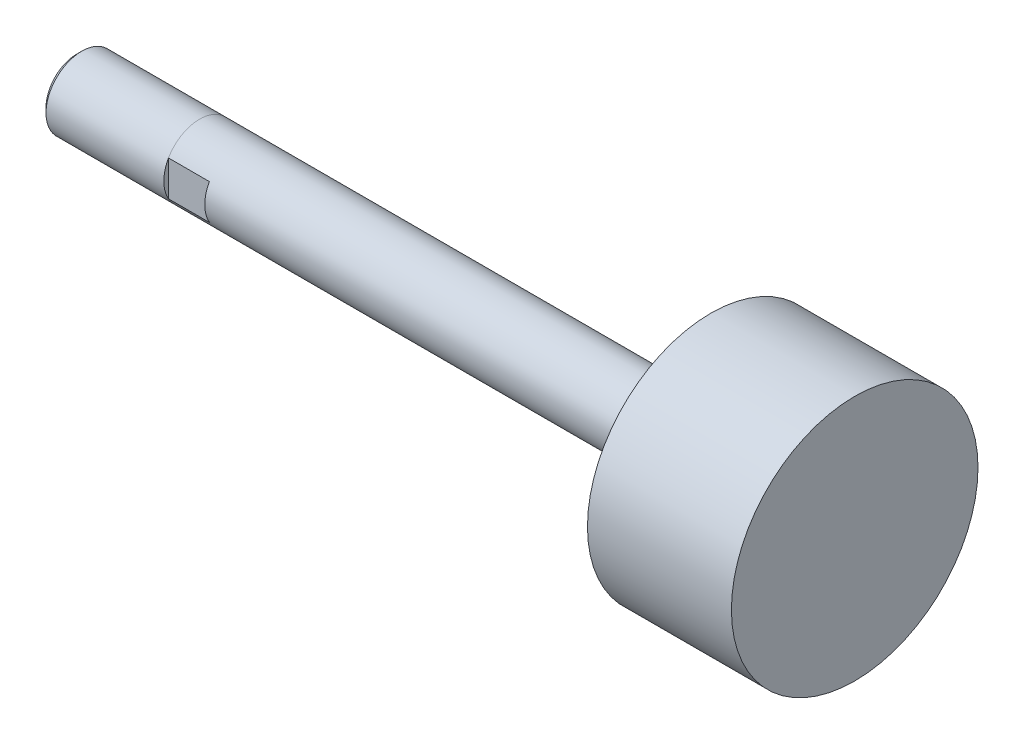
ISO-10303-21;
HEADER;
FILE_DESCRIPTION(('STEP AP214'),'2;1');
FILE_NAME('part.step','',(''),(''),'','','');
FILE_SCHEMA(('AUTOMOTIVE_DESIGN { 1 0 10303 214 1 1 1 1 }'));
ENDSEC;
DATA;
#1=APPLICATION_CONTEXT('core data for automotive mechanical design processes');
#2=APPLICATION_PROTOCOL_DEFINITION('international standard','automotive_design',2000,#1);
#3=PRODUCT_CONTEXT('',#1,'mechanical');
#4=PRODUCT('Part','Part','',(#3));
#5=PRODUCT_RELATED_PRODUCT_CATEGORY('part','',(#4));
#6=PRODUCT_DEFINITION_FORMATION('','',#4);
#7=PRODUCT_DEFINITION_CONTEXT('part definition',#1,'design');
#8=PRODUCT_DEFINITION('design','',#6,#7);
#9=PRODUCT_DEFINITION_SHAPE('','',#8);
#10=(LENGTH_UNIT() NAMED_UNIT(*) SI_UNIT(.MILLI.,.METRE.));
#11=(NAMED_UNIT(*) PLANE_ANGLE_UNIT() SI_UNIT($,.RADIAN.));
#12=(NAMED_UNIT(*) SI_UNIT($,.STERADIAN.) SOLID_ANGLE_UNIT());
#13=UNCERTAINTY_MEASURE_WITH_UNIT(LENGTH_MEASURE(1.E-05),#10,'distance_accuracy_value','');
#14=(GEOMETRIC_REPRESENTATION_CONTEXT(3) GLOBAL_UNCERTAINTY_ASSIGNED_CONTEXT((#13)) GLOBAL_UNIT_ASSIGNED_CONTEXT((#10,
#11,#12)) REPRESENTATION_CONTEXT('',''));
#15=CARTESIAN_POINT('',(0.,0.,0.));
#16=DIRECTION('',(0.,0.,1.));
#17=DIRECTION('',(1.,0.,0.));
#18=AXIS2_PLACEMENT_3D('',#15,#16,#17);
#19=CARTESIAN_POINT('',(95.377,0.,0.));
#20=DIRECTION('',(-1.,0.,0.));
#21=DIRECTION('',(0.,0.,1.));
#22=AXIS2_PLACEMENT_3D('',#19,#20,#21);
#23=CYLINDRICAL_SURFACE('',#22,5.5499);
#24=DIRECTION('',(-1.,0.,0.));
#25=VECTOR('',#24,1.);
#26=CARTESIAN_POINT('',(95.377,-2.74064116768321,4.826));
#27=LINE('',#26,#25);
#28=CARTESIAN_POINT('',(0.,-2.74064116768321,4.826));
#29=VERTEX_POINT('',#28);
#30=CARTESIAN_POINT('',(-6.35,-2.74705930837324,4.826));
#31=VERTEX_POINT('',#30);
#32=EDGE_CURVE('E112',#29,#31,#27,.T.);
#33=ORIENTED_EDGE('',*,*,#32,.T.);
#34=CARTESIAN_POINT('',(-6.35,0.,0.));
#35=DIRECTION('',(-1.,0.,0.));
#36=DIRECTION('',(0.,-0.494691305732761,-0.869068761394871));
#37=AXIS2_PLACEMENT_3D('',#34,#35,#36);
#38=CIRCLE('',#37,5.55625);
#39=CARTESIAN_POINT('',(-6.35,-2.74705792258195,-4.82600401218282));
#40=VERTEX_POINT('',#39);
#41=EDGE_CURVE('E94',#40,#31,#38,.T.);
#42=ORIENTED_EDGE('',*,*,#41,.F.);
#43=DIRECTION('',(-1.,0.,0.));
#44=VECTOR('',#43,1.);
#45=CARTESIAN_POINT('',(95.377,-2.74064116768321,-4.826));
#46=LINE('',#45,#44);
#47=CARTESIAN_POINT('',(0.,-2.74064116768321,-4.826));
#48=VERTEX_POINT('',#47);
#49=EDGE_CURVE('E103',#40,#48,#46,.F.);
#50=ORIENTED_EDGE('',*,*,#49,.T.);
#51=CARTESIAN_POINT('',(0.,0.,0.));
#52=DIRECTION('',(1.,0.,0.));
#53=DIRECTION('',(0.,0.,-1.));
#54=AXIS2_PLACEMENT_3D('',#51,#52,#53);
#55=CIRCLE('',#54,5.5499);
#56=CARTESIAN_POINT('',(0.,2.74064116768321,-4.826));
#57=VERTEX_POINT('',#56);
#58=EDGE_CURVE('E40',#48,#57,#55,.T.);
#59=ORIENTED_EDGE('',*,*,#58,.T.);
#60=DIRECTION('',(-1.,0.,0.));
#61=VECTOR('',#60,1.);
#62=CARTESIAN_POINT('',(95.377,2.74064116768321,-4.826));
#63=LINE('',#62,#61);
#64=CARTESIAN_POINT('',(-6.35,2.74705930837324,-4.826));
#65=VERTEX_POINT('',#64);
#66=EDGE_CURVE('E100',#57,#65,#63,.T.);
#67=ORIENTED_EDGE('',*,*,#66,.T.);
#68=CARTESIAN_POINT('',(-6.35,0.,0.));
#69=DIRECTION('',(-1.,0.,0.));
#70=DIRECTION('',(0.,0.49469130573276,0.869068761394872));
#71=AXIS2_PLACEMENT_3D('',#68,#69,#70);
#72=CIRCLE('',#71,5.55625);
#73=CARTESIAN_POINT('',(-6.35,2.74705792258195,4.82600401218283));
#74=VERTEX_POINT('',#73);
#75=EDGE_CURVE('E80',#74,#65,#72,.T.);
#76=ORIENTED_EDGE('',*,*,#75,.F.);
#77=DIRECTION('',(-1.,0.,0.));
#78=VECTOR('',#77,1.);
#79=CARTESIAN_POINT('',(95.377,2.74064116768321,4.826));
#80=LINE('',#79,#78);
#81=CARTESIAN_POINT('',(0.,2.74064116768321,4.826));
#82=VERTEX_POINT('',#81);
#83=EDGE_CURVE('E110',#74,#82,#80,.F.);
#84=ORIENTED_EDGE('',*,*,#83,.T.);
#85=EDGE_CURVE('E11',#82,#29,#55,.T.);
#86=ORIENTED_EDGE('',*,*,#85,.T.);
#87=EDGE_LOOP('',(#33,#42,#50,#59,#67,#76,#84,#86));
#88=FACE_BOUND('',#87,.T.);
#89=CARTESIAN_POINT('',(73.025,0.,0.));
#90=DIRECTION('',(-1.,0.,0.));
#91=DIRECTION('',(0.,0.,1.));
#92=AXIS2_PLACEMENT_3D('',#89,#90,#91);
#93=CIRCLE('',#92,5.5499);
#94=CARTESIAN_POINT('',(73.025,0.,5.5499));
#95=VERTEX_POINT('',#94);
#96=EDGE_CURVE('E199',#95,#95,#93,.T.);
#97=ORIENTED_EDGE('',*,*,#96,.T.);
#98=EDGE_LOOP('',(#97));
#99=FACE_BOUND('',#98,.T.);
#100=ADVANCED_FACE('F36',(#88,#99),#23,.T.);
#101=CARTESIAN_POINT('',(73.025,5.5499,0.));
#102=DIRECTION('',(1.,0.,0.));
#103=DIRECTION('',(0.,0.,-1.));
#104=AXIS2_PLACEMENT_3D('',#101,#102,#103);
#105=PLANE('',#104);
#106=ORIENTED_EDGE('',*,*,#96,.F.);
#107=EDGE_LOOP('',(#106));
#108=FACE_BOUND('',#107,.T.);
#109=CARTESIAN_POINT('',(73.025,0.,0.));
#110=DIRECTION('',(-1.,0.,0.));
#111=DIRECTION('',(0.,0.,1.));
#112=AXIS2_PLACEMENT_3D('',#109,#110,#111);
#113=CIRCLE('',#112,19.14525);
#114=CARTESIAN_POINT('',(73.025,0.,19.14525));
#115=VERTEX_POINT('',#114);
#116=EDGE_CURVE('E201',#115,#115,#113,.T.);
#117=ORIENTED_EDGE('',*,*,#116,.T.);
#118=EDGE_LOOP('',(#117));
#119=FACE_BOUND('',#118,.T.);
#120=ADVANCED_FACE('F219',(#108,#119),#105,.F.);
#121=CARTESIAN_POINT('',(95.377,0.,0.));
#122=DIRECTION('',(-1.,0.,0.));
#123=DIRECTION('',(0.,0.,1.));
#124=AXIS2_PLACEMENT_3D('',#121,#122,#123);
#125=CYLINDRICAL_SURFACE('',#124,19.14525);
#126=ORIENTED_EDGE('',*,*,#116,.F.);
#127=EDGE_LOOP('',(#126));
#128=FACE_BOUND('',#127,.T.);
#129=CARTESIAN_POINT('',(95.377,0.,0.));
#130=DIRECTION('',(-1.,0.,0.));
#131=DIRECTION('',(0.,0.,1.));
#132=AXIS2_PLACEMENT_3D('',#129,#130,#131);
#133=CIRCLE('',#132,19.14525);
#134=CARTESIAN_POINT('',(95.377,0.,19.14525));
#135=VERTEX_POINT('',#134);
#136=EDGE_CURVE('E144',#135,#135,#133,.T.);
#137=ORIENTED_EDGE('',*,*,#136,.T.);
#138=EDGE_LOOP('',(#137));
#139=FACE_BOUND('',#138,.T.);
#140=ADVANCED_FACE('F208',(#128,#139),#125,.T.);
#141=CARTESIAN_POINT('',(95.377,19.14525,0.));
#142=DIRECTION('',(-1.,0.,0.));
#143=DIRECTION('',(0.,0.,1.));
#144=AXIS2_PLACEMENT_3D('',#141,#142,#143);
#145=PLANE('',#144);
#146=ORIENTED_EDGE('',*,*,#136,.F.);
#147=EDGE_LOOP('',(#146));
#148=FACE_BOUND('',#147,.T.);
#149=ADVANCED_FACE('F210',(#148),#145,.F.);
#150=CARTESIAN_POINT('',(-25.4,0.,0.));
#151=DIRECTION('',(1.,0.,0.));
#152=DIRECTION('',(0.,0.,-1.));
#153=AXIS2_PLACEMENT_3D('',#150,#151,#152);
#154=PLANE('',#153);
#155=CARTESIAN_POINT('',(-25.4,0.,0.));
#156=DIRECTION('',(-1.,0.,0.));
#157=DIRECTION('',(0.,0.,1.));
#158=AXIS2_PLACEMENT_3D('',#155,#156,#157);
#159=CIRCLE('',#158,4.8006);
#160=CARTESIAN_POINT('',(-25.4,0.,4.8006));
#161=VERTEX_POINT('',#160);
#162=EDGE_CURVE('E137',#161,#161,#159,.T.);
#163=ORIENTED_EDGE('',*,*,#162,.T.);
#164=EDGE_LOOP('',(#163));
#165=FACE_BOUND('',#164,.T.);
#166=ADVANCED_FACE('F212',(#165),#154,.F.);
#167=CARTESIAN_POINT('',(-24.64435,0.,0.));
#168=DIRECTION('',(1.,0.,0.));
#169=DIRECTION('',(0.,0.,-1.));
#170=AXIS2_PLACEMENT_3D('',#167,#168,#169);
#171=CONICAL_SURFACE('',#170,5.55625,0.785398163397451);
#172=ORIENTED_EDGE('',*,*,#162,.F.);
#173=EDGE_LOOP('',(#172));
#174=FACE_BOUND('',#173,.T.);
#175=CARTESIAN_POINT('',(-24.64435,0.,0.));
#176=DIRECTION('',(-1.,0.,0.));
#177=DIRECTION('',(0.,0.,1.));
#178=AXIS2_PLACEMENT_3D('',#175,#176,#177);
#179=CIRCLE('',#178,5.55625);
#180=CARTESIAN_POINT('',(-24.64435,0.,5.55625));
#181=VERTEX_POINT('',#180);
#182=EDGE_CURVE('E134',#181,#181,#179,.T.);
#183=ORIENTED_EDGE('',*,*,#182,.T.);
#184=EDGE_LOOP('',(#183));
#185=FACE_BOUND('',#184,.T.);
#186=ADVANCED_FACE('F172',(#174,#185),#171,.T.);
#187=CARTESIAN_POINT('',(-6.35,0.,0.));
#188=DIRECTION('',(-1.,0.,0.));
#189=DIRECTION('',(0.,0.,1.));
#190=AXIS2_PLACEMENT_3D('',#187,#188,#189);
#191=CYLINDRICAL_SURFACE('',#190,5.55625);
#192=ORIENTED_EDGE('',*,*,#182,.F.);
#193=EDGE_LOOP('',(#192));
#194=FACE_BOUND('',#193,.T.);
#195=ORIENTED_EDGE('',*,*,#75,.T.);
#196=CARTESIAN_POINT('',(-6.35,0.,0.));
#197=DIRECTION('',(-1.,0.,0.));
#198=DIRECTION('',(0.,0.494691305732778,-0.869068761394862));
#199=AXIS2_PLACEMENT_3D('',#196,#197,#198);
#200=CIRCLE('',#199,5.55625);
#201=EDGE_CURVE('E83',#65,#40,#200,.T.);
#202=ORIENTED_EDGE('',*,*,#201,.T.);
#203=ORIENTED_EDGE('',*,*,#41,.T.);
#204=CARTESIAN_POINT('',(-6.35,0.,0.));
#205=DIRECTION('',(-1.,0.,0.));
#206=DIRECTION('',(0.,-0.494691305732759,0.869068761394873));
#207=AXIS2_PLACEMENT_3D('',#204,#205,#206);
#208=CIRCLE('',#207,5.55625);
#209=EDGE_CURVE('E85',#31,#74,#208,.T.);
#210=ORIENTED_EDGE('',*,*,#209,.T.);
#211=EDGE_LOOP('',(#195,#202,#203,#210));
#212=FACE_BOUND('',#211,.T.);
#213=ADVANCED_FACE('F82',(#194,#212),#191,.T.);
#214=CARTESIAN_POINT('',(-6.35,0.,0.));
#215=DIRECTION('',(1.,0.,0.));
#216=DIRECTION('',(0.,0.,-1.));
#217=AXIS2_PLACEMENT_3D('',#214,#215,#216);
#218=PLANE('',#217);
#219=ORIENTED_EDGE('',*,*,#201,.F.);
#220=DIRECTION('',(0.,1.,0.));
#221=VECTOR('',#220,1.);
#222=CARTESIAN_POINT('',(-6.35,-5.5499,-4.826));
#223=LINE('',#222,#221);
#224=EDGE_CURVE('E50',#40,#65,#223,.T.);
#225=ORIENTED_EDGE('',*,*,#224,.F.);
#226=EDGE_LOOP('',(#219,#225));
#227=FACE_BOUND('',#226,.T.);
#228=ADVANCED_FACE('F93',(#227),#218,.T.);
#229=CARTESIAN_POINT('',(0.,-5.5499,-4.826));
#230=DIRECTION('',(0.,0.,1.));
#231=DIRECTION('',(1.,0.,0.));
#232=AXIS2_PLACEMENT_3D('',#229,#230,#231);
#233=PLANE('',#232);
#234=DIRECTION('',(0.,1.,0.));
#235=VECTOR('',#234,1.);
#236=CARTESIAN_POINT('',(0.,-5.5499,-4.826));
#237=LINE('',#236,#235);
#238=EDGE_CURVE('E114',#48,#57,#237,.T.);
#239=ORIENTED_EDGE('',*,*,#238,.F.);
#240=ORIENTED_EDGE('',*,*,#49,.F.);
#241=ORIENTED_EDGE('',*,*,#224,.T.);
#242=ORIENTED_EDGE('',*,*,#66,.F.);
#243=EDGE_LOOP('',(#239,#240,#241,#242));
#244=FACE_BOUND('',#243,.T.);
#245=ADVANCED_FACE('F99',(#244),#233,.F.);
#246=CARTESIAN_POINT('',(0.,0.,0.));
#247=DIRECTION('',(1.,0.,0.));
#248=DIRECTION('',(0.,0.,-1.));
#249=AXIS2_PLACEMENT_3D('',#246,#247,#248);
#250=PLANE('',#249);
#251=ORIENTED_EDGE('',*,*,#238,.T.);
#252=ORIENTED_EDGE('',*,*,#58,.F.);
#253=EDGE_LOOP('',(#251,#252));
#254=FACE_BOUND('',#253,.T.);
#255=ADVANCED_FACE('F260',(#254),#250,.F.);
#256=DIRECTION('',(0.,-1.,0.));
#257=VECTOR('',#256,1.);
#258=CARTESIAN_POINT('',(0.,5.5499,4.826));
#259=LINE('',#258,#257);
#260=EDGE_CURVE('E105',#82,#29,#259,.T.);
#261=ORIENTED_EDGE('',*,*,#260,.T.);
#262=ORIENTED_EDGE('',*,*,#85,.F.);
#263=EDGE_LOOP('',(#261,#262));
#264=FACE_BOUND('',#263,.T.);
#265=ADVANCED_FACE('F131',(#264),#250,.F.);
#266=ORIENTED_EDGE('',*,*,#209,.F.);
#267=DIRECTION('',(0.,-1.,0.));
#268=VECTOR('',#267,1.);
#269=CARTESIAN_POINT('',(-6.35,5.5499,4.826));
#270=LINE('',#269,#268);
#271=EDGE_CURVE('E57',#74,#31,#270,.T.);
#272=ORIENTED_EDGE('',*,*,#271,.F.);
#273=EDGE_LOOP('',(#266,#272));
#274=FACE_BOUND('',#273,.T.);
#275=ADVANCED_FACE('F150',(#274),#218,.T.);
#276=CARTESIAN_POINT('',(0.,5.5499,4.826));
#277=DIRECTION('',(0.,0.,-1.));
#278=DIRECTION('',(-1.,0.,0.));
#279=AXIS2_PLACEMENT_3D('',#276,#277,#278);
#280=PLANE('',#279);
#281=ORIENTED_EDGE('',*,*,#260,.F.);
#282=ORIENTED_EDGE('',*,*,#83,.F.);
#283=ORIENTED_EDGE('',*,*,#271,.T.);
#284=ORIENTED_EDGE('',*,*,#32,.F.);
#285=EDGE_LOOP('',(#281,#282,#283,#284));
#286=FACE_BOUND('',#285,.T.);
#287=ADVANCED_FACE('F133',(#286),#280,.F.);
#288=CLOSED_SHELL('',(#100,#120,#140,#149,#166,#186,#213,#228,#245,#255,#265,#275,#287));
#289=MANIFOLD_SOLID_BREP('B2',#288);
#290=ADVANCED_BREP_SHAPE_REPRESENTATION('',(#18,#289),#14);
#291=SHAPE_DEFINITION_REPRESENTATION(#9,#290);
ENDSEC;
END-ISO-10303-21;
